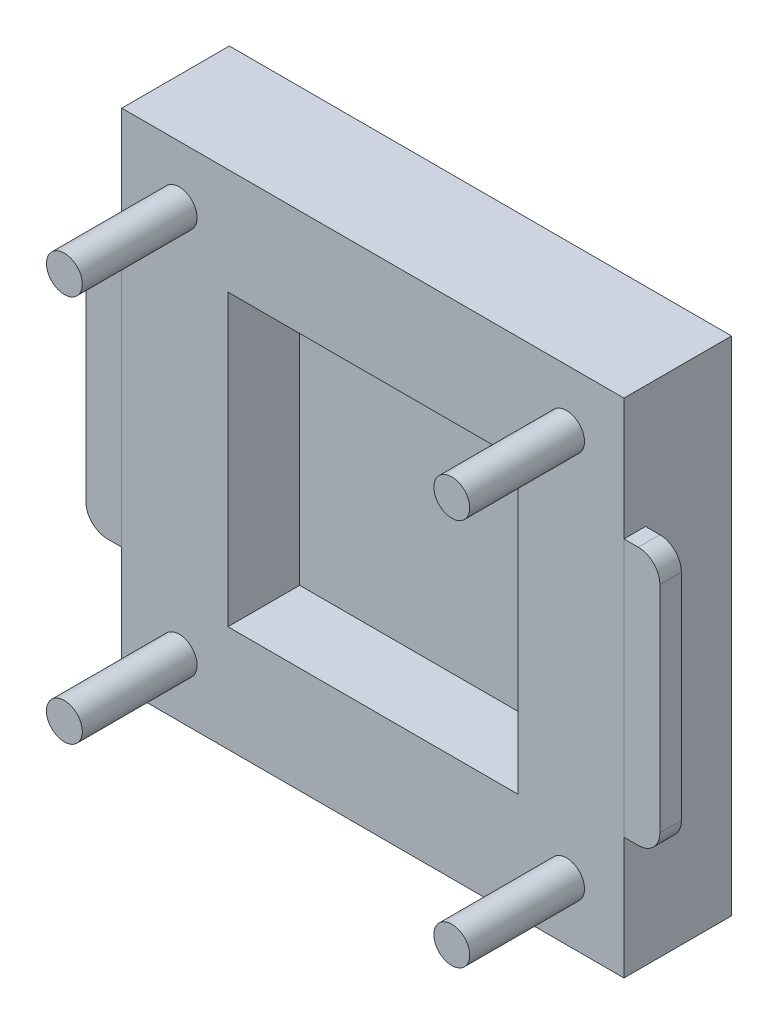
ISO-10303-21;
HEADER;
FILE_DESCRIPTION(('STEP AP214'),'2;1');
FILE_NAME('part.step','',(''),(''),'','','');
FILE_SCHEMA(('AUTOMOTIVE_DESIGN { 1 0 10303 214 1 1 1 1 }'));
ENDSEC;
DATA;
#1=APPLICATION_CONTEXT('core data for automotive mechanical design processes');
#2=APPLICATION_PROTOCOL_DEFINITION('international standard','automotive_design',2000,#1);
#3=PRODUCT_CONTEXT('',#1,'mechanical');
#4=PRODUCT('Part','Part','',(#3));
#5=PRODUCT_RELATED_PRODUCT_CATEGORY('part','',(#4));
#6=PRODUCT_DEFINITION_FORMATION('','',#4);
#7=PRODUCT_DEFINITION_CONTEXT('part definition',#1,'design');
#8=PRODUCT_DEFINITION('design','',#6,#7);
#9=PRODUCT_DEFINITION_SHAPE('','',#8);
#10=(LENGTH_UNIT() NAMED_UNIT(*) SI_UNIT(.MILLI.,.METRE.));
#11=(NAMED_UNIT(*) PLANE_ANGLE_UNIT() SI_UNIT($,.RADIAN.));
#12=(NAMED_UNIT(*) SI_UNIT($,.STERADIAN.) SOLID_ANGLE_UNIT());
#13=UNCERTAINTY_MEASURE_WITH_UNIT(LENGTH_MEASURE(1.E-05),#10,'distance_accuracy_value','');
#14=(GEOMETRIC_REPRESENTATION_CONTEXT(3) GLOBAL_UNCERTAINTY_ASSIGNED_CONTEXT((#13)) GLOBAL_UNIT_ASSIGNED_CONTEXT((#10,
#11,#12)) REPRESENTATION_CONTEXT('',''));
#15=CARTESIAN_POINT('',(0.,0.,0.));
#16=DIRECTION('',(0.,0.,1.));
#17=DIRECTION('',(1.,0.,0.));
#18=AXIS2_PLACEMENT_3D('',#15,#16,#17);
#19=CARTESIAN_POINT('',(72.,20.,12.));
#20=DIRECTION('',(0.,0.,1.));
#21=DIRECTION('',(1.,0.,0.));
#22=AXIS2_PLACEMENT_3D('',#19,#20,#21);
#23=CYLINDRICAL_SURFACE('',#22,3.);
#24=CARTESIAN_POINT('',(72.,20.,15.));
#25=DIRECTION('',(0.,0.,1.));
#26=DIRECTION('',(-1.,0.,0.));
#27=AXIS2_PLACEMENT_3D('',#24,#25,#26);
#28=CIRCLE('',#27,3.);
#29=CARTESIAN_POINT('',(72.,17.,15.));
#30=VERTEX_POINT('',#29);
#31=CARTESIAN_POINT('',(75.,20.,15.));
#32=VERTEX_POINT('',#31);
#33=EDGE_CURVE('E143',#30,#32,#28,.T.);
#34=ORIENTED_EDGE('',*,*,#33,.F.);
#35=DIRECTION('',(0.,0.,1.));
#36=VECTOR('',#35,1.);
#37=CARTESIAN_POINT('',(72.,17.,12.));
#38=LINE('',#37,#36);
#39=CARTESIAN_POINT('',(72.,17.,12.));
#40=VERTEX_POINT('',#39);
#41=EDGE_CURVE('E12',#40,#30,#38,.T.);
#42=ORIENTED_EDGE('',*,*,#41,.F.);
#43=CARTESIAN_POINT('',(72.,20.,12.));
#44=DIRECTION('',(0.,0.,1.));
#45=DIRECTION('',(-1.,0.,0.));
#46=AXIS2_PLACEMENT_3D('',#43,#44,#45);
#47=CIRCLE('',#46,3.);
#48=CARTESIAN_POINT('',(75.,20.,12.));
#49=VERTEX_POINT('',#48);
#50=EDGE_CURVE('E163',#40,#49,#47,.T.);
#51=ORIENTED_EDGE('',*,*,#50,.T.);
#52=DIRECTION('',(0.,0.,1.));
#53=VECTOR('',#52,1.);
#54=CARTESIAN_POINT('',(75.,20.,12.));
#55=LINE('',#54,#53);
#56=EDGE_CURVE('E54',#49,#32,#55,.T.);
#57=ORIENTED_EDGE('',*,*,#56,.T.);
#58=EDGE_LOOP('',(#34,#42,#51,#57));
#59=FACE_BOUND('',#58,.T.);
#60=ADVANCED_FACE('F51',(#59),#23,.T.);
#61=CARTESIAN_POINT('',(72.,17.,12.));
#62=DIRECTION('',(0.,-1.,0.));
#63=DIRECTION('',(0.,0.,-1.));
#64=AXIS2_PLACEMENT_3D('',#61,#62,#63);
#65=PLANE('',#64);
#66=DIRECTION('',(1.,0.,0.));
#67=VECTOR('',#66,1.);
#68=CARTESIAN_POINT('',(72.,17.,15.));
#69=LINE('',#68,#67);
#70=CARTESIAN_POINT('',(70.,17.,15.));
#71=VERTEX_POINT('',#70);
#72=EDGE_CURVE('E160',#71,#30,#69,.T.);
#73=ORIENTED_EDGE('',*,*,#72,.F.);
#74=DIRECTION('',(0.,0.,1.));
#75=VECTOR('',#74,1.);
#76=CARTESIAN_POINT('',(70.,17.,12.));
#77=LINE('',#76,#75);
#78=CARTESIAN_POINT('',(70.,17.,12.));
#79=VERTEX_POINT('',#78);
#80=EDGE_CURVE('E61',#79,#71,#77,.T.);
#81=ORIENTED_EDGE('',*,*,#80,.F.);
#82=DIRECTION('',(1.,0.,0.));
#83=VECTOR('',#82,1.);
#84=CARTESIAN_POINT('',(72.,17.,12.));
#85=LINE('',#84,#83);
#86=EDGE_CURVE('E128',#79,#40,#85,.T.);
#87=ORIENTED_EDGE('',*,*,#86,.T.);
#88=ORIENTED_EDGE('',*,*,#41,.T.);
#89=EDGE_LOOP('',(#73,#81,#87,#88));
#90=FACE_BOUND('',#89,.T.);
#91=ADVANCED_FACE('F175',(#90),#65,.T.);
#92=CARTESIAN_POINT('',(70.,53.,12.));
#93=DIRECTION('',(-1.,0.,0.));
#94=DIRECTION('',(0.,-1.,0.));
#95=AXIS2_PLACEMENT_3D('',#92,#93,#94);
#96=PLANE('',#95);
#97=DIRECTION('',(0.,-1.,0.));
#98=VECTOR('',#97,1.);
#99=CARTESIAN_POINT('',(70.,53.,15.));
#100=LINE('',#99,#98);
#101=CARTESIAN_POINT('',(70.,53.,15.));
#102=VERTEX_POINT('',#101);
#103=EDGE_CURVE('E114',#102,#71,#100,.T.);
#104=ORIENTED_EDGE('',*,*,#103,.F.);
#105=DIRECTION('',(0.,0.,1.));
#106=VECTOR('',#105,1.);
#107=CARTESIAN_POINT('',(70.,53.,12.));
#108=LINE('',#107,#106);
#109=CARTESIAN_POINT('',(70.,53.,12.));
#110=VERTEX_POINT('',#109);
#111=EDGE_CURVE('E109',#110,#102,#108,.T.);
#112=ORIENTED_EDGE('',*,*,#111,.F.);
#113=DIRECTION('',(0.,-1.,0.));
#114=VECTOR('',#113,1.);
#115=CARTESIAN_POINT('',(70.,53.,12.));
#116=LINE('',#115,#114);
#117=EDGE_CURVE('E112',#110,#79,#116,.T.);
#118=ORIENTED_EDGE('',*,*,#117,.T.);
#119=ORIENTED_EDGE('',*,*,#80,.T.);
#120=EDGE_LOOP('',(#104,#112,#118,#119));
#121=FACE_BOUND('',#120,.T.);
#122=ADVANCED_FACE('F111',(#121),#96,.T.);
#123=CARTESIAN_POINT('',(72.,53.,12.));
#124=DIRECTION('',(0.,1.,0.));
#125=DIRECTION('',(0.,0.,1.));
#126=AXIS2_PLACEMENT_3D('',#123,#124,#125);
#127=PLANE('',#126);
#128=DIRECTION('',(-1.,0.,0.));
#129=VECTOR('',#128,1.);
#130=CARTESIAN_POINT('',(72.,53.,15.));
#131=LINE('',#130,#129);
#132=CARTESIAN_POINT('',(72.,53.,15.));
#133=VERTEX_POINT('',#132);
#134=EDGE_CURVE('E155',#133,#102,#131,.T.);
#135=ORIENTED_EDGE('',*,*,#134,.F.);
#136=DIRECTION('',(0.,0.,1.));
#137=VECTOR('',#136,1.);
#138=CARTESIAN_POINT('',(72.,53.,12.));
#139=LINE('',#138,#137);
#140=CARTESIAN_POINT('',(72.,53.,12.));
#141=VERTEX_POINT('',#140);
#142=EDGE_CURVE('E120',#141,#133,#139,.T.);
#143=ORIENTED_EDGE('',*,*,#142,.F.);
#144=DIRECTION('',(-1.,0.,0.));
#145=VECTOR('',#144,1.);
#146=CARTESIAN_POINT('',(72.,53.,12.));
#147=LINE('',#146,#145);
#148=EDGE_CURVE('E126',#141,#110,#147,.T.);
#149=ORIENTED_EDGE('',*,*,#148,.T.);
#150=ORIENTED_EDGE('',*,*,#111,.T.);
#151=EDGE_LOOP('',(#135,#143,#149,#150));
#152=FACE_BOUND('',#151,.T.);
#153=ADVANCED_FACE('F131',(#152),#127,.T.);
#154=CARTESIAN_POINT('',(72.,50.,12.));
#155=DIRECTION('',(0.,0.,1.));
#156=DIRECTION('',(1.,0.,0.));
#157=AXIS2_PLACEMENT_3D('',#154,#155,#156);
#158=CYLINDRICAL_SURFACE('',#157,3.);
#159=CARTESIAN_POINT('',(72.,50.,15.));
#160=DIRECTION('',(0.,0.,1.));
#161=DIRECTION('',(-1.,0.,0.));
#162=AXIS2_PLACEMENT_3D('',#159,#160,#161);
#163=CIRCLE('',#162,3.);
#164=CARTESIAN_POINT('',(75.,50.,15.));
#165=VERTEX_POINT('',#164);
#166=EDGE_CURVE('E151',#165,#133,#163,.T.);
#167=ORIENTED_EDGE('',*,*,#166,.F.);
#168=DIRECTION('',(0.,0.,1.));
#169=VECTOR('',#168,1.);
#170=CARTESIAN_POINT('',(75.,50.,12.));
#171=LINE('',#170,#169);
#172=CARTESIAN_POINT('',(75.,50.,12.));
#173=VERTEX_POINT('',#172);
#174=EDGE_CURVE('E168',#173,#165,#171,.T.);
#175=ORIENTED_EDGE('',*,*,#174,.F.);
#176=CARTESIAN_POINT('',(72.,50.,12.));
#177=DIRECTION('',(0.,0.,1.));
#178=DIRECTION('',(-1.,0.,0.));
#179=AXIS2_PLACEMENT_3D('',#176,#177,#178);
#180=CIRCLE('',#179,3.);
#181=EDGE_CURVE('E133',#173,#141,#180,.T.);
#182=ORIENTED_EDGE('',*,*,#181,.T.);
#183=ORIENTED_EDGE('',*,*,#142,.T.);
#184=EDGE_LOOP('',(#167,#175,#182,#183));
#185=FACE_BOUND('',#184,.T.);
#186=ADVANCED_FACE('F188',(#185),#158,.T.);
#187=CARTESIAN_POINT('',(75.,50.,12.));
#188=DIRECTION('',(1.,0.,0.));
#189=DIRECTION('',(0.,0.,-1.));
#190=AXIS2_PLACEMENT_3D('',#187,#188,#189);
#191=PLANE('',#190);
#192=DIRECTION('',(0.,1.,0.));
#193=VECTOR('',#192,1.);
#194=CARTESIAN_POINT('',(75.,50.,15.));
#195=LINE('',#194,#193);
#196=EDGE_CURVE('E147',#32,#165,#195,.T.);
#197=ORIENTED_EDGE('',*,*,#196,.F.);
#198=ORIENTED_EDGE('',*,*,#56,.F.);
#199=DIRECTION('',(0.,1.,0.));
#200=VECTOR('',#199,1.);
#201=CARTESIAN_POINT('',(75.,50.,12.));
#202=LINE('',#201,#200);
#203=EDGE_CURVE('E137',#49,#173,#202,.T.);
#204=ORIENTED_EDGE('',*,*,#203,.T.);
#205=ORIENTED_EDGE('',*,*,#174,.T.);
#206=EDGE_LOOP('',(#197,#198,#204,#205));
#207=FACE_BOUND('',#206,.T.);
#208=ADVANCED_FACE('F172',(#207),#191,.T.);
#209=CARTESIAN_POINT('',(72.,20.,12.));
#210=DIRECTION('',(0.,0.,-1.));
#211=DIRECTION('',(-1.,0.,0.));
#212=AXIS2_PLACEMENT_3D('',#209,#210,#211);
#213=PLANE('',#212);
#214=ORIENTED_EDGE('',*,*,#50,.F.);
#215=ORIENTED_EDGE('',*,*,#86,.F.);
#216=ORIENTED_EDGE('',*,*,#117,.F.);
#217=ORIENTED_EDGE('',*,*,#148,.F.);
#218=ORIENTED_EDGE('',*,*,#181,.F.);
#219=ORIENTED_EDGE('',*,*,#203,.F.);
#220=EDGE_LOOP('',(#214,#215,#216,#217,#218,#219));
#221=FACE_BOUND('',#220,.T.);
#222=ADVANCED_FACE('F124',(#221),#213,.T.);
#223=CARTESIAN_POINT('',(72.,20.,15.));
#224=DIRECTION('',(0.,0.,-1.));
#225=DIRECTION('',(-1.,0.,0.));
#226=AXIS2_PLACEMENT_3D('',#223,#224,#225);
#227=PLANE('',#226);
#228=ORIENTED_EDGE('',*,*,#33,.T.);
#229=ORIENTED_EDGE('',*,*,#196,.T.);
#230=ORIENTED_EDGE('',*,*,#166,.T.);
#231=ORIENTED_EDGE('',*,*,#134,.T.);
#232=ORIENTED_EDGE('',*,*,#103,.T.);
#233=ORIENTED_EDGE('',*,*,#72,.T.);
#234=EDGE_LOOP('',(#228,#229,#230,#231,#232,#233));
#235=FACE_BOUND('',#234,.T.);
#236=ADVANCED_FACE('F174',(#235),#227,.F.);
#237=CLOSED_SHELL('',(#60,#91,#122,#153,#186,#208,#222,#236));
#238=MANIFOLD_SOLID_BREP('B2',#237);
#239=CARTESIAN_POINT('',(0.,53.,12.));
#240=DIRECTION('',(1.,0.,0.));
#241=DIRECTION('',(0.,0.,-1.));
#242=AXIS2_PLACEMENT_3D('',#239,#240,#241);
#243=PLANE('',#242);
#244=DIRECTION('',(0.,1.,0.));
#245=VECTOR('',#244,1.);
#246=CARTESIAN_POINT('',(0.,53.,15.));
#247=LINE('',#246,#245);
#248=CARTESIAN_POINT('',(0.,17.,15.));
#249=VERTEX_POINT('',#248);
#250=CARTESIAN_POINT('',(0.,53.,15.));
#251=VERTEX_POINT('',#250);
#252=EDGE_CURVE('E353',#249,#251,#247,.T.);
#253=ORIENTED_EDGE('',*,*,#252,.F.);
#254=DIRECTION('',(0.,0.,1.));
#255=VECTOR('',#254,1.);
#256=CARTESIAN_POINT('',(0.,17.,12.));
#257=LINE('',#256,#255);
#258=CARTESIAN_POINT('',(0.,17.,12.));
#259=VERTEX_POINT('',#258);
#260=EDGE_CURVE('E49',#259,#249,#257,.T.);
#261=ORIENTED_EDGE('',*,*,#260,.F.);
#262=DIRECTION('',(0.,1.,0.));
#263=VECTOR('',#262,1.);
#264=CARTESIAN_POINT('',(0.,53.,12.));
#265=LINE('',#264,#263);
#266=CARTESIAN_POINT('',(0.,53.,12.));
#267=VERTEX_POINT('',#266);
#268=EDGE_CURVE('E373',#259,#267,#265,.T.);
#269=ORIENTED_EDGE('',*,*,#268,.T.);
#270=DIRECTION('',(0.,0.,1.));
#271=VECTOR('',#270,1.);
#272=CARTESIAN_POINT('',(0.,53.,12.));
#273=LINE('',#272,#271);
#274=EDGE_CURVE('E264',#267,#251,#273,.T.);
#275=ORIENTED_EDGE('',*,*,#274,.T.);
#276=EDGE_LOOP('',(#253,#261,#269,#275));
#277=FACE_BOUND('',#276,.T.);
#278=ADVANCED_FACE('F261',(#277),#243,.T.);
#279=CARTESIAN_POINT('',(-2.,17.,12.));
#280=DIRECTION('',(0.,-1.,0.));
#281=DIRECTION('',(0.,0.,-1.));
#282=AXIS2_PLACEMENT_3D('',#279,#280,#281);
#283=PLANE('',#282);
#284=DIRECTION('',(1.,0.,0.));
#285=VECTOR('',#284,1.);
#286=CARTESIAN_POINT('',(-2.,17.,15.));
#287=LINE('',#286,#285);
#288=CARTESIAN_POINT('',(-2.,17.,15.));
#289=VERTEX_POINT('',#288);
#290=EDGE_CURVE('E370',#289,#249,#287,.T.);
#291=ORIENTED_EDGE('',*,*,#290,.F.);
#292=DIRECTION('',(0.,0.,1.));
#293=VECTOR('',#292,1.);
#294=CARTESIAN_POINT('',(-2.,17.,12.));
#295=LINE('',#294,#293);
#296=CARTESIAN_POINT('',(-2.,17.,12.));
#297=VERTEX_POINT('',#296);
#298=EDGE_CURVE('E271',#297,#289,#295,.T.);
#299=ORIENTED_EDGE('',*,*,#298,.F.);
#300=DIRECTION('',(1.,0.,0.));
#301=VECTOR('',#300,1.);
#302=CARTESIAN_POINT('',(-2.,17.,12.));
#303=LINE('',#302,#301);
#304=EDGE_CURVE('E338',#297,#259,#303,.T.);
#305=ORIENTED_EDGE('',*,*,#304,.T.);
#306=ORIENTED_EDGE('',*,*,#260,.T.);
#307=EDGE_LOOP('',(#291,#299,#305,#306));
#308=FACE_BOUND('',#307,.T.);
#309=ADVANCED_FACE('F386',(#308),#283,.T.);
#310=CARTESIAN_POINT('',(-2.,20.,12.));
#311=DIRECTION('',(0.,0.,1.));
#312=DIRECTION('',(1.,0.,0.));
#313=AXIS2_PLACEMENT_3D('',#310,#311,#312);
#314=CYLINDRICAL_SURFACE('',#313,3.);
#315=CARTESIAN_POINT('',(-2.,20.,15.));
#316=DIRECTION('',(0.,0.,1.));
#317=DIRECTION('',(1.,0.,0.));
#318=AXIS2_PLACEMENT_3D('',#315,#316,#317);
#319=CIRCLE('',#318,3.);
#320=CARTESIAN_POINT('',(-5.,20.,15.));
#321=VERTEX_POINT('',#320);
#322=EDGE_CURVE('E324',#321,#289,#319,.T.);
#323=ORIENTED_EDGE('',*,*,#322,.F.);
#324=DIRECTION('',(0.,0.,1.));
#325=VECTOR('',#324,1.);
#326=CARTESIAN_POINT('',(-5.,20.,12.));
#327=LINE('',#326,#325);
#328=CARTESIAN_POINT('',(-5.,20.,12.));
#329=VERTEX_POINT('',#328);
#330=EDGE_CURVE('E319',#329,#321,#327,.T.);
#331=ORIENTED_EDGE('',*,*,#330,.F.);
#332=CARTESIAN_POINT('',(-2.,20.,12.));
#333=DIRECTION('',(0.,0.,1.));
#334=DIRECTION('',(1.,0.,0.));
#335=AXIS2_PLACEMENT_3D('',#332,#333,#334);
#336=CIRCLE('',#335,3.);
#337=EDGE_CURVE('E322',#329,#297,#336,.T.);
#338=ORIENTED_EDGE('',*,*,#337,.T.);
#339=ORIENTED_EDGE('',*,*,#298,.T.);
#340=EDGE_LOOP('',(#323,#331,#338,#339));
#341=FACE_BOUND('',#340,.T.);
#342=ADVANCED_FACE('F321',(#341),#314,.T.);
#343=CARTESIAN_POINT('',(-5.,50.,12.));
#344=DIRECTION('',(-1.,0.,0.));
#345=DIRECTION('',(0.,0.,1.));
#346=AXIS2_PLACEMENT_3D('',#343,#344,#345);
#347=PLANE('',#346);
#348=DIRECTION('',(0.,-1.,0.));
#349=VECTOR('',#348,1.);
#350=CARTESIAN_POINT('',(-5.,50.,15.));
#351=LINE('',#350,#349);
#352=CARTESIAN_POINT('',(-5.,50.,15.));
#353=VERTEX_POINT('',#352);
#354=EDGE_CURVE('E365',#353,#321,#351,.T.);
#355=ORIENTED_EDGE('',*,*,#354,.F.);
#356=DIRECTION('',(0.,0.,1.));
#357=VECTOR('',#356,1.);
#358=CARTESIAN_POINT('',(-5.,50.,12.));
#359=LINE('',#358,#357);
#360=CARTESIAN_POINT('',(-5.,50.,12.));
#361=VERTEX_POINT('',#360);
#362=EDGE_CURVE('E330',#361,#353,#359,.T.);
#363=ORIENTED_EDGE('',*,*,#362,.F.);
#364=DIRECTION('',(0.,-1.,0.));
#365=VECTOR('',#364,1.);
#366=CARTESIAN_POINT('',(-5.,50.,12.));
#367=LINE('',#366,#365);
#368=EDGE_CURVE('E336',#361,#329,#367,.T.);
#369=ORIENTED_EDGE('',*,*,#368,.T.);
#370=ORIENTED_EDGE('',*,*,#330,.T.);
#371=EDGE_LOOP('',(#355,#363,#369,#370));
#372=FACE_BOUND('',#371,.T.);
#373=ADVANCED_FACE('F341',(#372),#347,.T.);
#374=CARTESIAN_POINT('',(-2.,50.,12.));
#375=DIRECTION('',(0.,0.,1.));
#376=DIRECTION('',(1.,0.,0.));
#377=AXIS2_PLACEMENT_3D('',#374,#375,#376);
#378=CYLINDRICAL_SURFACE('',#377,3.);
#379=CARTESIAN_POINT('',(-2.,50.,15.));
#380=DIRECTION('',(0.,0.,1.));
#381=DIRECTION('',(1.,0.,0.));
#382=AXIS2_PLACEMENT_3D('',#379,#380,#381);
#383=CIRCLE('',#382,3.);
#384=CARTESIAN_POINT('',(-2.,53.,15.));
#385=VERTEX_POINT('',#384);
#386=EDGE_CURVE('E361',#385,#353,#383,.T.);
#387=ORIENTED_EDGE('',*,*,#386,.F.);
#388=DIRECTION('',(0.,0.,1.));
#389=VECTOR('',#388,1.);
#390=CARTESIAN_POINT('',(-2.,53.,12.));
#391=LINE('',#390,#389);
#392=CARTESIAN_POINT('',(-2.,53.,12.));
#393=VERTEX_POINT('',#392);
#394=EDGE_CURVE('E378',#393,#385,#391,.T.);
#395=ORIENTED_EDGE('',*,*,#394,.F.);
#396=CARTESIAN_POINT('',(-2.,50.,12.));
#397=DIRECTION('',(0.,0.,1.));
#398=DIRECTION('',(1.,0.,0.));
#399=AXIS2_PLACEMENT_3D('',#396,#397,#398);
#400=CIRCLE('',#399,3.);
#401=EDGE_CURVE('E343',#393,#361,#400,.T.);
#402=ORIENTED_EDGE('',*,*,#401,.T.);
#403=ORIENTED_EDGE('',*,*,#362,.T.);
#404=EDGE_LOOP('',(#387,#395,#402,#403));
#405=FACE_BOUND('',#404,.T.);
#406=ADVANCED_FACE('F399',(#405),#378,.T.);
#407=CARTESIAN_POINT('',(-2.,53.,12.));
#408=DIRECTION('',(0.,1.,0.));
#409=DIRECTION('',(0.,0.,1.));
#410=AXIS2_PLACEMENT_3D('',#407,#408,#409);
#411=PLANE('',#410);
#412=DIRECTION('',(-1.,0.,0.));
#413=VECTOR('',#412,1.);
#414=CARTESIAN_POINT('',(-2.,53.,15.));
#415=LINE('',#414,#413);
#416=EDGE_CURVE('E357',#251,#385,#415,.T.);
#417=ORIENTED_EDGE('',*,*,#416,.F.);
#418=ORIENTED_EDGE('',*,*,#274,.F.);
#419=DIRECTION('',(-1.,0.,0.));
#420=VECTOR('',#419,1.);
#421=CARTESIAN_POINT('',(-2.,53.,12.));
#422=LINE('',#421,#420);
#423=EDGE_CURVE('E348',#267,#393,#422,.T.);
#424=ORIENTED_EDGE('',*,*,#423,.T.);
#425=ORIENTED_EDGE('',*,*,#394,.T.);
#426=EDGE_LOOP('',(#417,#418,#424,#425));
#427=FACE_BOUND('',#426,.T.);
#428=ADVANCED_FACE('F383',(#427),#411,.T.);
#429=CARTESIAN_POINT('',(-2.,20.,12.));
#430=DIRECTION('',(0.,0.,1.));
#431=DIRECTION('',(1.,0.,0.));
#432=AXIS2_PLACEMENT_3D('',#429,#430,#431);
#433=PLANE('',#432);
#434=ORIENTED_EDGE('',*,*,#268,.F.);
#435=ORIENTED_EDGE('',*,*,#304,.F.);
#436=ORIENTED_EDGE('',*,*,#337,.F.);
#437=ORIENTED_EDGE('',*,*,#368,.F.);
#438=ORIENTED_EDGE('',*,*,#401,.F.);
#439=ORIENTED_EDGE('',*,*,#423,.F.);
#440=EDGE_LOOP('',(#434,#435,#436,#437,#438,#439));
#441=FACE_BOUND('',#440,.T.);
#442=ADVANCED_FACE('F334',(#441),#433,.F.);
#443=CARTESIAN_POINT('',(-2.,20.,15.));
#444=DIRECTION('',(0.,0.,1.));
#445=DIRECTION('',(1.,0.,0.));
#446=AXIS2_PLACEMENT_3D('',#443,#444,#445);
#447=PLANE('',#446);
#448=ORIENTED_EDGE('',*,*,#252,.T.);
#449=ORIENTED_EDGE('',*,*,#416,.T.);
#450=ORIENTED_EDGE('',*,*,#386,.T.);
#451=ORIENTED_EDGE('',*,*,#354,.T.);
#452=ORIENTED_EDGE('',*,*,#322,.T.);
#453=ORIENTED_EDGE('',*,*,#290,.T.);
#454=EDGE_LOOP('',(#448,#449,#450,#451,#452,#453));
#455=FACE_BOUND('',#454,.T.);
#456=ADVANCED_FACE('F385',(#455),#447,.T.);
#457=CLOSED_SHELL('',(#278,#309,#342,#373,#406,#428,#442,#456));
#458=MANIFOLD_SOLID_BREP('B6',#457);
#459=CARTESIAN_POINT('',(0.,0.,15.));
#460=DIRECTION('',(1.,0.,0.));
#461=DIRECTION('',(0.,1.,0.));
#462=AXIS2_PLACEMENT_3D('',#459,#460,#461);
#463=PLANE('',#462);
#464=DIRECTION('',(0.,-1.,0.));
#465=VECTOR('',#464,1.);
#466=CARTESIAN_POINT('',(0.,0.,0.));
#467=LINE('',#466,#465);
#468=CARTESIAN_POINT('',(0.,70.,0.));
#469=VERTEX_POINT('',#468);
#470=CARTESIAN_POINT('',(0.,0.,0.));
#471=VERTEX_POINT('',#470);
#472=EDGE_CURVE('E587',#469,#471,#467,.T.);
#473=ORIENTED_EDGE('',*,*,#472,.T.);
#474=DIRECTION('',(0.,0.,-1.));
#475=VECTOR('',#474,1.);
#476=CARTESIAN_POINT('',(0.,0.,15.));
#477=LINE('',#476,#475);
#478=CARTESIAN_POINT('',(0.,0.,15.));
#479=VERTEX_POINT('',#478);
#480=EDGE_CURVE('E623',#479,#471,#477,.T.);
#481=ORIENTED_EDGE('',*,*,#480,.F.);
#482=DIRECTION('',(0.,-1.,0.));
#483=VECTOR('',#482,1.);
#484=CARTESIAN_POINT('',(0.,0.,15.));
#485=LINE('',#484,#483);
#486=CARTESIAN_POINT('',(0.,70.,15.));
#487=VERTEX_POINT('',#486);
#488=EDGE_CURVE('E593',#487,#479,#485,.T.);
#489=ORIENTED_EDGE('',*,*,#488,.F.);
#490=DIRECTION('',(0.,0.,-1.));
#491=VECTOR('',#490,1.);
#492=CARTESIAN_POINT('',(0.,70.,15.));
#493=LINE('',#492,#491);
#494=EDGE_CURVE('E603',#487,#469,#493,.T.);
#495=ORIENTED_EDGE('',*,*,#494,.T.);
#496=EDGE_LOOP('',(#473,#481,#489,#495));
#497=FACE_BOUND('',#496,.T.);
#498=ADVANCED_FACE('F462',(#497),#463,.F.);
#499=CARTESIAN_POINT('',(0.,0.,15.));
#500=DIRECTION('',(0.,1.,0.));
#501=DIRECTION('',(0.,0.,1.));
#502=AXIS2_PLACEMENT_3D('',#499,#500,#501);
#503=PLANE('',#502);
#504=DIRECTION('',(1.,0.,0.));
#505=VECTOR('',#504,1.);
#506=CARTESIAN_POINT('',(0.,0.,0.));
#507=LINE('',#506,#505);
#508=CARTESIAN_POINT('',(70.,0.,0.));
#509=VERTEX_POINT('',#508);
#510=EDGE_CURVE('E607',#471,#509,#507,.T.);
#511=ORIENTED_EDGE('',*,*,#510,.T.);
#512=DIRECTION('',(0.,0.,-1.));
#513=VECTOR('',#512,1.);
#514=CARTESIAN_POINT('',(70.,0.,15.));
#515=LINE('',#514,#513);
#516=CARTESIAN_POINT('',(70.,0.,15.));
#517=VERTEX_POINT('',#516);
#518=EDGE_CURVE('E619',#517,#509,#515,.T.);
#519=ORIENTED_EDGE('',*,*,#518,.F.);
#520=DIRECTION('',(1.,0.,0.));
#521=VECTOR('',#520,1.);
#522=CARTESIAN_POINT('',(0.,0.,15.));
#523=LINE('',#522,#521);
#524=EDGE_CURVE('E515',#479,#517,#523,.T.);
#525=ORIENTED_EDGE('',*,*,#524,.F.);
#526=ORIENTED_EDGE('',*,*,#480,.T.);
#527=EDGE_LOOP('',(#511,#519,#525,#526));
#528=FACE_BOUND('',#527,.T.);
#529=ADVANCED_FACE('F655',(#528),#503,.F.);
#530=CARTESIAN_POINT('',(70.,0.,15.));
#531=DIRECTION('',(-1.,0.,0.));
#532=DIRECTION('',(0.,-1.,0.));
#533=AXIS2_PLACEMENT_3D('',#530,#531,#532);
#534=PLANE('',#533);
#535=DIRECTION('',(0.,1.,0.));
#536=VECTOR('',#535,1.);
#537=CARTESIAN_POINT('',(70.,0.,0.));
#538=LINE('',#537,#536);
#539=CARTESIAN_POINT('',(70.,70.,0.));
#540=VERTEX_POINT('',#539);
#541=EDGE_CURVE('E610',#509,#540,#538,.T.);
#542=ORIENTED_EDGE('',*,*,#541,.T.);
#543=DIRECTION('',(0.,0.,-1.));
#544=VECTOR('',#543,1.);
#545=CARTESIAN_POINT('',(70.,70.,15.));
#546=LINE('',#545,#544);
#547=CARTESIAN_POINT('',(70.,70.,15.));
#548=VERTEX_POINT('',#547);
#549=EDGE_CURVE('E617',#548,#540,#546,.T.);
#550=ORIENTED_EDGE('',*,*,#549,.F.);
#551=DIRECTION('',(0.,1.,0.));
#552=VECTOR('',#551,1.);
#553=CARTESIAN_POINT('',(70.,0.,15.));
#554=LINE('',#553,#552);
#555=EDGE_CURVE('E598',#517,#548,#554,.T.);
#556=ORIENTED_EDGE('',*,*,#555,.F.);
#557=ORIENTED_EDGE('',*,*,#518,.T.);
#558=EDGE_LOOP('',(#542,#550,#556,#557));
#559=FACE_BOUND('',#558,.T.);
#560=ADVANCED_FACE('F660',(#559),#534,.F.);
#561=CARTESIAN_POINT('',(0.,70.,15.));
#562=DIRECTION('',(0.,-1.,0.));
#563=DIRECTION('',(0.,0.,-1.));
#564=AXIS2_PLACEMENT_3D('',#561,#562,#563);
#565=PLANE('',#564);
#566=DIRECTION('',(-1.,0.,0.));
#567=VECTOR('',#566,1.);
#568=CARTESIAN_POINT('',(0.,70.,0.));
#569=LINE('',#568,#567);
#570=EDGE_CURVE('E507',#540,#469,#569,.T.);
#571=ORIENTED_EDGE('',*,*,#570,.T.);
#572=ORIENTED_EDGE('',*,*,#494,.F.);
#573=DIRECTION('',(-1.,0.,0.));
#574=VECTOR('',#573,1.);
#575=CARTESIAN_POINT('',(0.,70.,15.));
#576=LINE('',#575,#574);
#577=EDGE_CURVE('E486',#548,#487,#576,.T.);
#578=ORIENTED_EDGE('',*,*,#577,.F.);
#579=ORIENTED_EDGE('',*,*,#549,.T.);
#580=EDGE_LOOP('',(#571,#572,#578,#579));
#581=FACE_BOUND('',#580,.T.);
#582=ADVANCED_FACE('F643',(#581),#565,.F.);
#583=CARTESIAN_POINT('',(0.,0.,15.));
#584=DIRECTION('',(0.,0.,-1.));
#585=DIRECTION('',(-1.,0.,0.));
#586=AXIS2_PLACEMENT_3D('',#583,#584,#585);
#587=PLANE('',#586);
#588=CARTESIAN_POINT('',(8.00000000000001,7.99999999999999,15.));
#589=DIRECTION('',(0.,0.,-1.));
#590=DIRECTION('',(-1.,0.,0.));
#591=AXIS2_PLACEMENT_3D('',#588,#589,#590);
#592=CIRCLE('',#591,2.5);
#593=CARTESIAN_POINT('',(5.50000000000001,7.99999999999999,15.));
#594=VERTEX_POINT('',#593);
#595=EDGE_CURVE('E259',#594,#594,#592,.F.);
#596=ORIENTED_EDGE('',*,*,#595,.F.);
#597=EDGE_LOOP('',(#596));
#598=FACE_BOUND('',#597,.T.);
#599=CARTESIAN_POINT('',(62.,7.99999999999999,15.));
#600=DIRECTION('',(0.,0.,-1.));
#601=DIRECTION('',(-1.,0.,0.));
#602=AXIS2_PLACEMENT_3D('',#599,#600,#601);
#603=CIRCLE('',#602,2.5);
#604=CARTESIAN_POINT('',(59.5,7.99999999999999,15.));
#605=VERTEX_POINT('',#604);
#606=EDGE_CURVE('E470',#605,#605,#603,.F.);
#607=ORIENTED_EDGE('',*,*,#606,.F.);
#608=EDGE_LOOP('',(#607));
#609=FACE_BOUND('',#608,.T.);
#610=CARTESIAN_POINT('',(62.,62.,15.));
#611=DIRECTION('',(0.,0.,-1.));
#612=DIRECTION('',(-1.,0.,0.));
#613=AXIS2_PLACEMENT_3D('',#610,#611,#612);
#614=CIRCLE('',#613,2.5);
#615=CARTESIAN_POINT('',(59.5,62.,15.));
#616=VERTEX_POINT('',#615);
#617=EDGE_CURVE('E630',#616,#616,#614,.F.);
#618=ORIENTED_EDGE('',*,*,#617,.F.);
#619=EDGE_LOOP('',(#618));
#620=FACE_BOUND('',#619,.T.);
#621=CARTESIAN_POINT('',(7.99999999999999,62.,15.));
#622=DIRECTION('',(0.,0.,-1.));
#623=DIRECTION('',(-1.,0.,0.));
#624=AXIS2_PLACEMENT_3D('',#621,#622,#623);
#625=CIRCLE('',#624,2.5);
#626=CARTESIAN_POINT('',(5.49999999999999,62.,15.));
#627=VERTEX_POINT('',#626);
#628=EDGE_CURVE('E626',#627,#627,#625,.F.);
#629=ORIENTED_EDGE('',*,*,#628,.F.);
#630=EDGE_LOOP('',(#629));
#631=FACE_BOUND('',#630,.T.);
#632=DIRECTION('',(1.,0.,0.));
#633=VECTOR('',#632,1.);
#634=CARTESIAN_POINT('',(14.8,14.8,15.));
#635=LINE('',#634,#633);
#636=CARTESIAN_POINT('',(14.8,14.8,15.));
#637=VERTEX_POINT('',#636);
#638=CARTESIAN_POINT('',(55.2,14.8,15.));
#639=VERTEX_POINT('',#638);
#640=EDGE_CURVE('E578',#637,#639,#635,.T.);
#641=ORIENTED_EDGE('',*,*,#640,.F.);
#642=DIRECTION('',(0.,-1.,0.));
#643=VECTOR('',#642,1.);
#644=CARTESIAN_POINT('',(14.8,55.2,15.));
#645=LINE('',#644,#643);
#646=CARTESIAN_POINT('',(14.8,55.2,15.));
#647=VERTEX_POINT('',#646);
#648=EDGE_CURVE('E477',#647,#637,#645,.T.);
#649=ORIENTED_EDGE('',*,*,#648,.F.);
#650=DIRECTION('',(-1.,0.,0.));
#651=VECTOR('',#650,1.);
#652=CARTESIAN_POINT('',(14.8,55.2,15.));
#653=LINE('',#652,#651);
#654=CARTESIAN_POINT('',(55.2,55.2,15.));
#655=VERTEX_POINT('',#654);
#656=EDGE_CURVE('E560',#655,#647,#653,.T.);
#657=ORIENTED_EDGE('',*,*,#656,.F.);
#658=DIRECTION('',(0.,1.,0.));
#659=VECTOR('',#658,1.);
#660=CARTESIAN_POINT('',(55.2,55.2,15.));
#661=LINE('',#660,#659);
#662=EDGE_CURVE('E566',#639,#655,#661,.T.);
#663=ORIENTED_EDGE('',*,*,#662,.F.);
#664=EDGE_LOOP('',(#641,#649,#657,#663));
#665=FACE_BOUND('',#664,.T.);
#666=ORIENTED_EDGE('',*,*,#488,.T.);
#667=ORIENTED_EDGE('',*,*,#524,.T.);
#668=ORIENTED_EDGE('',*,*,#555,.T.);
#669=ORIENTED_EDGE('',*,*,#577,.T.);
#670=EDGE_LOOP('',(#666,#667,#668,#669));
#671=FACE_BOUND('',#670,.T.);
#672=ADVANCED_FACE('F639',(#598,#609,#620,#631,#665,#671),#587,.F.);
#673=CARTESIAN_POINT('',(0.,0.,0.));
#674=DIRECTION('',(0.,0.,-1.));
#675=DIRECTION('',(-1.,0.,0.));
#676=AXIS2_PLACEMENT_3D('',#673,#674,#675);
#677=PLANE('',#676);
#678=ORIENTED_EDGE('',*,*,#472,.F.);
#679=ORIENTED_EDGE('',*,*,#570,.F.);
#680=ORIENTED_EDGE('',*,*,#541,.F.);
#681=ORIENTED_EDGE('',*,*,#510,.F.);
#682=EDGE_LOOP('',(#678,#679,#680,#681));
#683=FACE_BOUND('',#682,.T.);
#684=ADVANCED_FACE('F642',(#683),#677,.T.);
#685=CARTESIAN_POINT('',(14.8,55.2,5.));
#686=DIRECTION('',(-1.,0.,0.));
#687=DIRECTION('',(0.,-1.,0.));
#688=AXIS2_PLACEMENT_3D('',#685,#686,#687);
#689=PLANE('',#688);
#690=ORIENTED_EDGE('',*,*,#648,.T.);
#691=DIRECTION('',(0.,0.,1.));
#692=VECTOR('',#691,1.);
#693=CARTESIAN_POINT('',(14.8,14.8,5.));
#694=LINE('',#693,#692);
#695=CARTESIAN_POINT('',(14.8,14.8,5.));
#696=VERTEX_POINT('',#695);
#697=EDGE_CURVE('E535',#696,#637,#694,.T.);
#698=ORIENTED_EDGE('',*,*,#697,.F.);
#699=DIRECTION('',(0.,-1.,0.));
#700=VECTOR('',#699,1.);
#701=CARTESIAN_POINT('',(14.8,55.2,5.));
#702=LINE('',#701,#700);
#703=CARTESIAN_POINT('',(14.8,55.2,5.));
#704=VERTEX_POINT('',#703);
#705=EDGE_CURVE('E539',#704,#696,#702,.T.);
#706=ORIENTED_EDGE('',*,*,#705,.F.);
#707=DIRECTION('',(0.,0.,1.));
#708=VECTOR('',#707,1.);
#709=CARTESIAN_POINT('',(14.8,55.2,5.));
#710=LINE('',#709,#708);
#711=EDGE_CURVE('E584',#704,#647,#710,.T.);
#712=ORIENTED_EDGE('',*,*,#711,.T.);
#713=EDGE_LOOP('',(#690,#698,#706,#712));
#714=FACE_BOUND('',#713,.T.);
#715=ADVANCED_FACE('F537',(#714),#689,.F.);
#716=CARTESIAN_POINT('',(14.8,55.2,5.));
#717=DIRECTION('',(0.,1.,0.));
#718=DIRECTION('',(0.,0.,1.));
#719=AXIS2_PLACEMENT_3D('',#716,#717,#718);
#720=PLANE('',#719);
#721=ORIENTED_EDGE('',*,*,#656,.T.);
#722=ORIENTED_EDGE('',*,*,#711,.F.);
#723=DIRECTION('',(-1.,0.,0.));
#724=VECTOR('',#723,1.);
#725=CARTESIAN_POINT('',(14.8,55.2,5.));
#726=LINE('',#725,#724);
#727=CARTESIAN_POINT('',(55.2,55.2,5.));
#728=VERTEX_POINT('',#727);
#729=EDGE_CURVE('E546',#728,#704,#726,.T.);
#730=ORIENTED_EDGE('',*,*,#729,.F.);
#731=DIRECTION('',(0.,0.,1.));
#732=VECTOR('',#731,1.);
#733=CARTESIAN_POINT('',(55.2,55.2,5.));
#734=LINE('',#733,#732);
#735=EDGE_CURVE('E588',#728,#655,#734,.T.);
#736=ORIENTED_EDGE('',*,*,#735,.T.);
#737=EDGE_LOOP('',(#721,#722,#730,#736));
#738=FACE_BOUND('',#737,.T.);
#739=ADVANCED_FACE('F667',(#738),#720,.F.);
#740=CARTESIAN_POINT('',(55.2,55.2,5.));
#741=DIRECTION('',(1.,0.,0.));
#742=DIRECTION('',(0.,1.,0.));
#743=AXIS2_PLACEMENT_3D('',#740,#741,#742);
#744=PLANE('',#743);
#745=ORIENTED_EDGE('',*,*,#662,.T.);
#746=ORIENTED_EDGE('',*,*,#735,.F.);
#747=DIRECTION('',(0.,1.,0.));
#748=VECTOR('',#747,1.);
#749=CARTESIAN_POINT('',(55.2,55.2,5.));
#750=LINE('',#749,#748);
#751=CARTESIAN_POINT('',(55.2,14.8,5.));
#752=VERTEX_POINT('',#751);
#753=EDGE_CURVE('E555',#752,#728,#750,.T.);
#754=ORIENTED_EDGE('',*,*,#753,.F.);
#755=DIRECTION('',(0.,0.,1.));
#756=VECTOR('',#755,1.);
#757=CARTESIAN_POINT('',(55.2,14.8,5.));
#758=LINE('',#757,#756);
#759=EDGE_CURVE('E545',#752,#639,#758,.T.);
#760=ORIENTED_EDGE('',*,*,#759,.T.);
#761=EDGE_LOOP('',(#745,#746,#754,#760));
#762=FACE_BOUND('',#761,.T.);
#763=ADVANCED_FACE('F703',(#762),#744,.F.);
#764=CARTESIAN_POINT('',(14.8,14.8,5.));
#765=DIRECTION('',(0.,-1.,0.));
#766=DIRECTION('',(0.,0.,-1.));
#767=AXIS2_PLACEMENT_3D('',#764,#765,#766);
#768=PLANE('',#767);
#769=ORIENTED_EDGE('',*,*,#640,.T.);
#770=ORIENTED_EDGE('',*,*,#759,.F.);
#771=DIRECTION('',(1.,0.,0.));
#772=VECTOR('',#771,1.);
#773=CARTESIAN_POINT('',(14.8,14.8,5.));
#774=LINE('',#773,#772);
#775=EDGE_CURVE('E549',#696,#752,#774,.T.);
#776=ORIENTED_EDGE('',*,*,#775,.F.);
#777=ORIENTED_EDGE('',*,*,#697,.T.);
#778=EDGE_LOOP('',(#769,#770,#776,#777));
#779=FACE_BOUND('',#778,.T.);
#780=ADVANCED_FACE('F550',(#779),#768,.F.);
#781=CARTESIAN_POINT('',(0.,0.,5.));
#782=DIRECTION('',(0.,0.,1.));
#783=DIRECTION('',(1.,0.,0.));
#784=AXIS2_PLACEMENT_3D('',#781,#782,#783);
#785=PLANE('',#784);
#786=ORIENTED_EDGE('',*,*,#705,.T.);
#787=ORIENTED_EDGE('',*,*,#775,.T.);
#788=ORIENTED_EDGE('',*,*,#753,.T.);
#789=ORIENTED_EDGE('',*,*,#729,.T.);
#790=EDGE_LOOP('',(#786,#787,#788,#789));
#791=FACE_BOUND('',#790,.T.);
#792=ADVANCED_FACE('F557',(#791),#785,.T.);
#793=CARTESIAN_POINT('',(7.99999999999999,62.,31.));
#794=DIRECTION('',(0.,0.,-1.));
#795=DIRECTION('',(-1.,0.,0.));
#796=AXIS2_PLACEMENT_3D('',#793,#794,#795);
#797=CYLINDRICAL_SURFACE('',#796,2.5);
#798=CARTESIAN_POINT('',(7.99999999999999,62.,31.));
#799=DIRECTION('',(0.,0.,1.));
#800=DIRECTION('',(1.,0.,0.));
#801=AXIS2_PLACEMENT_3D('',#798,#799,#800);
#802=CIRCLE('',#801,2.5);
#803=CARTESIAN_POINT('',(10.5,62.,31.));
#804=VERTEX_POINT('',#803);
#805=EDGE_CURVE('E569',#804,#804,#802,.T.);
#806=ORIENTED_EDGE('',*,*,#805,.F.);
#807=EDGE_LOOP('',(#806));
#808=FACE_BOUND('',#807,.T.);
#809=ORIENTED_EDGE('',*,*,#628,.T.);
#810=EDGE_LOOP('',(#809));
#811=FACE_BOUND('',#810,.T.);
#812=ADVANCED_FACE('F726',(#808,#811),#797,.T.);
#813=CARTESIAN_POINT('',(7.99999999999999,62.,31.));
#814=DIRECTION('',(0.,0.,1.));
#815=DIRECTION('',(1.,0.,0.));
#816=AXIS2_PLACEMENT_3D('',#813,#814,#815);
#817=PLANE('',#816);
#818=ORIENTED_EDGE('',*,*,#805,.T.);
#819=EDGE_LOOP('',(#818));
#820=FACE_BOUND('',#819,.T.);
#821=ADVANCED_FACE('F733',(#820),#817,.T.);
#822=CARTESIAN_POINT('',(62.,62.,31.));
#823=DIRECTION('',(0.,0.,-1.));
#824=DIRECTION('',(-1.,0.,0.));
#825=AXIS2_PLACEMENT_3D('',#822,#823,#824);
#826=CYLINDRICAL_SURFACE('',#825,2.5);
#827=CARTESIAN_POINT('',(62.,62.,31.));
#828=DIRECTION('',(0.,0.,1.));
#829=DIRECTION('',(-1.,0.,0.));
#830=AXIS2_PLACEMENT_3D('',#827,#828,#829);
#831=CIRCLE('',#830,2.5);
#832=CARTESIAN_POINT('',(59.5,62.,31.));
#833=VERTEX_POINT('',#832);
#834=EDGE_CURVE('E856',#833,#833,#831,.T.);
#835=ORIENTED_EDGE('',*,*,#834,.F.);
#836=EDGE_LOOP('',(#835));
#837=FACE_BOUND('',#836,.T.);
#838=ORIENTED_EDGE('',*,*,#617,.T.);
#839=EDGE_LOOP('',(#838));
#840=FACE_BOUND('',#839,.T.);
#841=ADVANCED_FACE('F742',(#837,#840),#826,.T.);
#842=CARTESIAN_POINT('',(62.,62.,31.));
#843=DIRECTION('',(0.,0.,-1.));
#844=DIRECTION('',(-1.,0.,0.));
#845=AXIS2_PLACEMENT_3D('',#842,#843,#844);
#846=PLANE('',#845);
#847=ORIENTED_EDGE('',*,*,#834,.T.);
#848=EDGE_LOOP('',(#847));
#849=FACE_BOUND('',#848,.T.);
#850=ADVANCED_FACE('F751',(#849),#846,.F.);
#851=CARTESIAN_POINT('',(62.,7.99999999999999,31.));
#852=DIRECTION('',(0.,0.,-1.));
#853=DIRECTION('',(-1.,0.,0.));
#854=AXIS2_PLACEMENT_3D('',#851,#852,#853);
#855=CYLINDRICAL_SURFACE('',#854,2.5);
#856=CARTESIAN_POINT('',(62.,7.99999999999999,31.));
#857=DIRECTION('',(0.,0.,1.));
#858=DIRECTION('',(1.,0.,0.));
#859=AXIS2_PLACEMENT_3D('',#856,#857,#858);
#860=CIRCLE('',#859,2.5);
#861=CARTESIAN_POINT('',(64.5,7.99999999999999,31.));
#862=VERTEX_POINT('',#861);
#863=EDGE_CURVE('E852',#862,#862,#860,.T.);
#864=ORIENTED_EDGE('',*,*,#863,.F.);
#865=EDGE_LOOP('',(#864));
#866=FACE_BOUND('',#865,.T.);
#867=ORIENTED_EDGE('',*,*,#606,.T.);
#868=EDGE_LOOP('',(#867));
#869=FACE_BOUND('',#868,.T.);
#870=ADVANCED_FACE('F637',(#866,#869),#855,.T.);
#871=CARTESIAN_POINT('',(62.,7.99999999999999,31.));
#872=DIRECTION('',(0.,0.,1.));
#873=DIRECTION('',(1.,0.,0.));
#874=AXIS2_PLACEMENT_3D('',#871,#872,#873);
#875=PLANE('',#874);
#876=ORIENTED_EDGE('',*,*,#863,.T.);
#877=EDGE_LOOP('',(#876));
#878=FACE_BOUND('',#877,.T.);
#879=ADVANCED_FACE('F768',(#878),#875,.T.);
#880=CARTESIAN_POINT('',(8.00000000000001,7.99999999999999,31.));
#881=DIRECTION('',(0.,0.,-1.));
#882=DIRECTION('',(-1.,0.,0.));
#883=AXIS2_PLACEMENT_3D('',#880,#881,#882);
#884=CYLINDRICAL_SURFACE('',#883,2.5);
#885=CARTESIAN_POINT('',(8.00000000000001,7.99999999999999,31.));
#886=DIRECTION('',(0.,0.,1.));
#887=DIRECTION('',(-1.,0.,0.));
#888=AXIS2_PLACEMENT_3D('',#885,#886,#887);
#889=CIRCLE('',#888,2.5);
#890=CARTESIAN_POINT('',(5.50000000000001,7.99999999999999,31.));
#891=VERTEX_POINT('',#890);
#892=EDGE_CURVE('E850',#891,#891,#889,.T.);
#893=ORIENTED_EDGE('',*,*,#892,.F.);
#894=EDGE_LOOP('',(#893));
#895=FACE_BOUND('',#894,.T.);
#896=ORIENTED_EDGE('',*,*,#595,.T.);
#897=EDGE_LOOP('',(#896));
#898=FACE_BOUND('',#897,.T.);
#899=ADVANCED_FACE('F777',(#895,#898),#884,.T.);
#900=CARTESIAN_POINT('',(8.00000000000001,7.99999999999999,31.));
#901=DIRECTION('',(0.,0.,-1.));
#902=DIRECTION('',(-1.,0.,0.));
#903=AXIS2_PLACEMENT_3D('',#900,#901,#902);
#904=PLANE('',#903);
#905=ORIENTED_EDGE('',*,*,#892,.T.);
#906=EDGE_LOOP('',(#905));
#907=FACE_BOUND('',#906,.T.);
#908=ADVANCED_FACE('F786',(#907),#904,.F.);
#909=CLOSED_SHELL('',(#498,#529,#560,#582,#672,#684,#715,#739,#763,#780,#792,#812,#821,#841,
#850,#870,#879,#899,#908));
#910=MANIFOLD_SOLID_BREP('B43',#909);
#911=ADVANCED_BREP_SHAPE_REPRESENTATION('',(#18,#238,#458,#910),#14);
#912=SHAPE_DEFINITION_REPRESENTATION(#9,#911);
ENDSEC;
END-ISO-10303-21;
